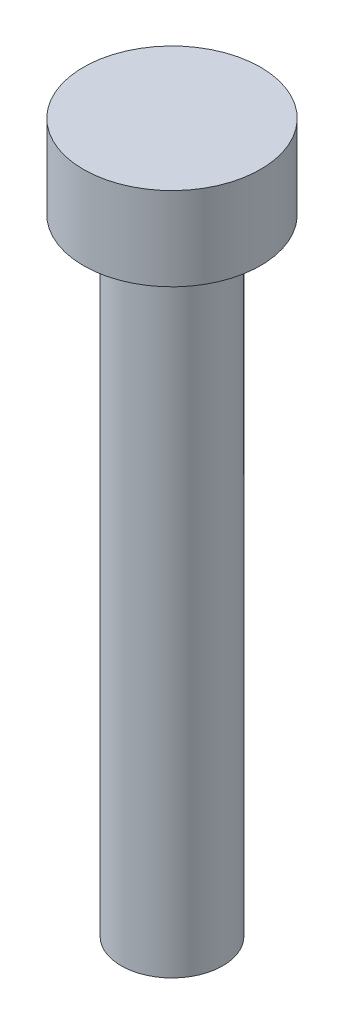
ISO-10303-21;
HEADER;
FILE_DESCRIPTION(('STEP AP214'),'2;1');
FILE_NAME('part.step','',(''),(''),'','','');
FILE_SCHEMA(('AUTOMOTIVE_DESIGN { 1 0 10303 214 1 1 1 1 }'));
ENDSEC;
DATA;
#1=APPLICATION_CONTEXT('core data for automotive mechanical design processes');
#2=APPLICATION_PROTOCOL_DEFINITION('international standard','automotive_design',2000,#1);
#3=PRODUCT_CONTEXT('',#1,'mechanical');
#4=PRODUCT('Part','Part','',(#3));
#5=PRODUCT_RELATED_PRODUCT_CATEGORY('part','',(#4));
#6=PRODUCT_DEFINITION_FORMATION('','',#4);
#7=PRODUCT_DEFINITION_CONTEXT('part definition',#1,'design');
#8=PRODUCT_DEFINITION('design','',#6,#7);
#9=PRODUCT_DEFINITION_SHAPE('','',#8);
#10=(LENGTH_UNIT() NAMED_UNIT(*) SI_UNIT(.MILLI.,.METRE.));
#11=(NAMED_UNIT(*) PLANE_ANGLE_UNIT() SI_UNIT($,.RADIAN.));
#12=(NAMED_UNIT(*) SI_UNIT($,.STERADIAN.) SOLID_ANGLE_UNIT());
#13=UNCERTAINTY_MEASURE_WITH_UNIT(LENGTH_MEASURE(1.E-05),#10,'distance_accuracy_value','');
#14=(GEOMETRIC_REPRESENTATION_CONTEXT(3) GLOBAL_UNCERTAINTY_ASSIGNED_CONTEXT((#13)) GLOBAL_UNIT_ASSIGNED_CONTEXT((#10,
#11,#12)) REPRESENTATION_CONTEXT('',''));
#15=CARTESIAN_POINT('',(0.,0.,0.));
#16=DIRECTION('',(0.,0.,1.));
#17=DIRECTION('',(1.,0.,0.));
#18=AXIS2_PLACEMENT_3D('',#15,#16,#17);
#19=CARTESIAN_POINT('',(0.,4.,0.));
#20=DIRECTION('',(0.,-1.,0.));
#21=DIRECTION('',(0.,0.,-1.));
#22=AXIS2_PLACEMENT_3D('',#19,#20,#21);
#23=CYLINDRICAL_SURFACE('',#22,4.25);
#24=CARTESIAN_POINT('',(0.,4.,0.));
#25=DIRECTION('',(0.,1.,0.));
#26=DIRECTION('',(0.,0.,1.));
#27=AXIS2_PLACEMENT_3D('',#24,#25,#26);
#28=CIRCLE('',#27,4.25);
#29=CARTESIAN_POINT('',(0.,4.,4.25));
#30=VERTEX_POINT('',#29);
#31=EDGE_CURVE('E40',#30,#30,#28,.T.);
#32=ORIENTED_EDGE('',*,*,#31,.F.);
#33=EDGE_LOOP('',(#32));
#34=FACE_BOUND('',#33,.T.);
#35=CARTESIAN_POINT('',(0.,0.,0.));
#36=DIRECTION('',(0.,1.,0.));
#37=DIRECTION('',(0.,0.,1.));
#38=AXIS2_PLACEMENT_3D('',#35,#36,#37);
#39=CIRCLE('',#38,4.25);
#40=CARTESIAN_POINT('',(0.,0.,4.25));
#41=VERTEX_POINT('',#40);
#42=EDGE_CURVE('E36',#41,#41,#39,.T.);
#43=ORIENTED_EDGE('',*,*,#42,.T.);
#44=EDGE_LOOP('',(#43));
#45=FACE_BOUND('',#44,.T.);
#46=ADVANCED_FACE('F33',(#34,#45),#23,.T.);
#47=CARTESIAN_POINT('',(0.,4.,0.));
#48=DIRECTION('',(0.,1.,0.));
#49=DIRECTION('',(0.,0.,1.));
#50=AXIS2_PLACEMENT_3D('',#47,#48,#49);
#51=PLANE('',#50);
#52=ORIENTED_EDGE('',*,*,#31,.T.);
#53=EDGE_LOOP('',(#52));
#54=FACE_BOUND('',#53,.T.);
#55=ADVANCED_FACE('F57',(#54),#51,.T.);
#56=CARTESIAN_POINT('',(0.,0.,0.));
#57=DIRECTION('',(0.,1.,0.));
#58=DIRECTION('',(0.,0.,1.));
#59=AXIS2_PLACEMENT_3D('',#56,#57,#58);
#60=PLANE('',#59);
#61=CARTESIAN_POINT('',(0.,0.,0.));
#62=DIRECTION('',(0.,-1.,0.));
#63=DIRECTION('',(0.,0.,-1.));
#64=AXIS2_PLACEMENT_3D('',#61,#62,#63);
#65=CIRCLE('',#64,2.44);
#66=CARTESIAN_POINT('',(0.,0.,-2.44));
#67=VERTEX_POINT('',#66);
#68=EDGE_CURVE('E10',#67,#67,#65,.T.);
#69=ORIENTED_EDGE('',*,*,#68,.F.);
#70=EDGE_LOOP('',(#69));
#71=FACE_BOUND('',#70,.T.);
#72=ORIENTED_EDGE('',*,*,#42,.F.);
#73=EDGE_LOOP('',(#72));
#74=FACE_BOUND('',#73,.T.);
#75=ADVANCED_FACE('F54',(#71,#74),#60,.F.);
#76=CARTESIAN_POINT('',(0.,-30.,0.));
#77=DIRECTION('',(0.,1.,0.));
#78=DIRECTION('',(0.,0.,1.));
#79=AXIS2_PLACEMENT_3D('',#76,#77,#78);
#80=CYLINDRICAL_SURFACE('',#79,2.44);
#81=CARTESIAN_POINT('',(0.,-30.,0.));
#82=DIRECTION('',(0.,-1.,0.));
#83=DIRECTION('',(0.,0.,-1.));
#84=AXIS2_PLACEMENT_3D('',#81,#82,#83);
#85=CIRCLE('',#84,2.44);
#86=CARTESIAN_POINT('',(0.,-30.,-2.44));
#87=VERTEX_POINT('',#86);
#88=EDGE_CURVE('E46',#87,#87,#85,.T.);
#89=ORIENTED_EDGE('',*,*,#88,.F.);
#90=EDGE_LOOP('',(#89));
#91=FACE_BOUND('',#90,.T.);
#92=ORIENTED_EDGE('',*,*,#68,.T.);
#93=EDGE_LOOP('',(#92));
#94=FACE_BOUND('',#93,.T.);
#95=ADVANCED_FACE('F56',(#91,#94),#80,.T.);
#96=CARTESIAN_POINT('',(0.,-30.,0.));
#97=DIRECTION('',(0.,-1.,0.));
#98=DIRECTION('',(0.,0.,-1.));
#99=AXIS2_PLACEMENT_3D('',#96,#97,#98);
#100=PLANE('',#99);
#101=ORIENTED_EDGE('',*,*,#88,.T.);
#102=EDGE_LOOP('',(#101));
#103=FACE_BOUND('',#102,.T.);
#104=ADVANCED_FACE('F63',(#103),#100,.T.);
#105=CLOSED_SHELL('',(#46,#55,#75,#95,#104));
#106=MANIFOLD_SOLID_BREP('B2',#105);
#107=ADVANCED_BREP_SHAPE_REPRESENTATION('',(#18,#106),#14);
#108=SHAPE_DEFINITION_REPRESENTATION(#9,#107);
ENDSEC;
END-ISO-10303-21;
